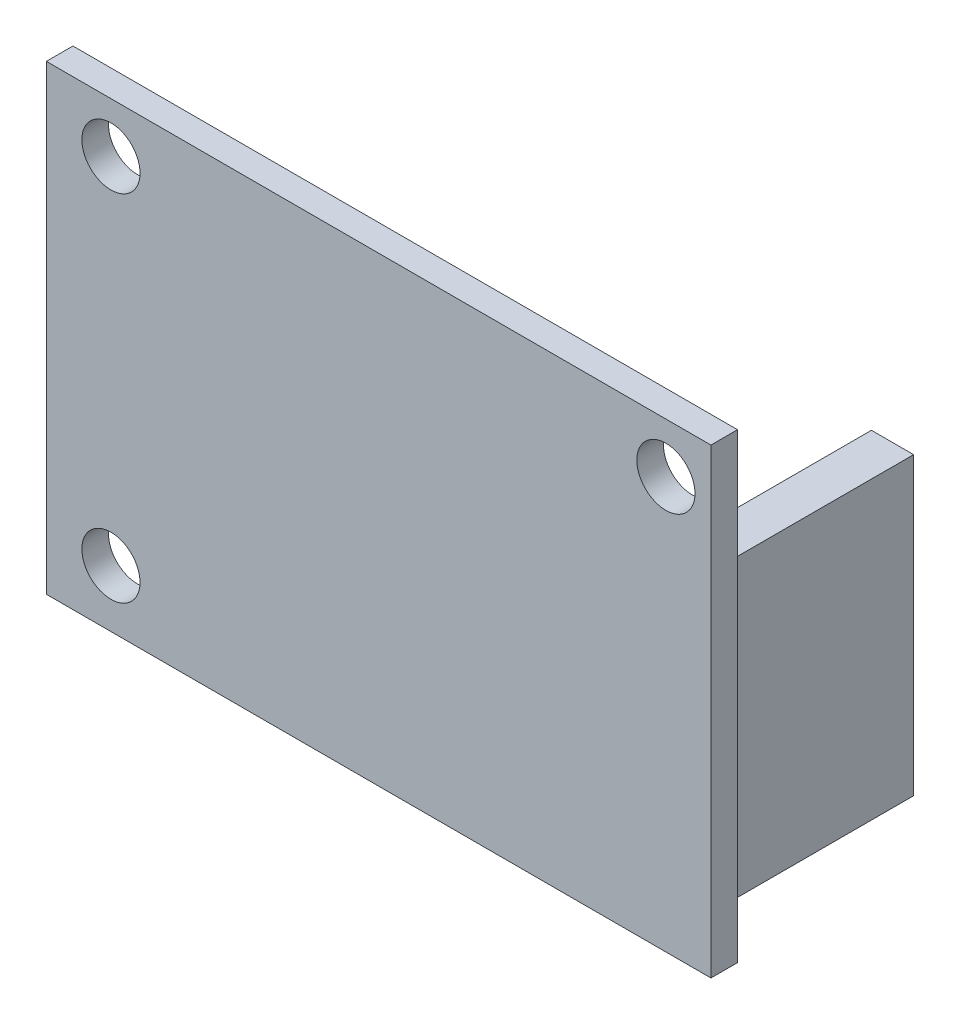
ISO-10303-21;
HEADER;
FILE_DESCRIPTION(('STEP AP214'),'2;1');
FILE_NAME('part.step','',(''),(''),'','','');
FILE_SCHEMA(('AUTOMOTIVE_DESIGN { 1 0 10303 214 1 1 1 1 }'));
ENDSEC;
DATA;
#1=APPLICATION_CONTEXT('core data for automotive mechanical design processes');
#2=APPLICATION_PROTOCOL_DEFINITION('international standard','automotive_design',2000,#1);
#3=PRODUCT_CONTEXT('',#1,'mechanical');
#4=PRODUCT('Part','Part','',(#3));
#5=PRODUCT_RELATED_PRODUCT_CATEGORY('part','',(#4));
#6=PRODUCT_DEFINITION_FORMATION('','',#4);
#7=PRODUCT_DEFINITION_CONTEXT('part definition',#1,'design');
#8=PRODUCT_DEFINITION('design','',#6,#7);
#9=PRODUCT_DEFINITION_SHAPE('','',#8);
#10=(LENGTH_UNIT() NAMED_UNIT(*) SI_UNIT(.MILLI.,.METRE.));
#11=(NAMED_UNIT(*) PLANE_ANGLE_UNIT() SI_UNIT($,.RADIAN.));
#12=(NAMED_UNIT(*) SI_UNIT($,.STERADIAN.) SOLID_ANGLE_UNIT());
#13=UNCERTAINTY_MEASURE_WITH_UNIT(LENGTH_MEASURE(1.E-05),#10,'distance_accuracy_value','');
#14=(GEOMETRIC_REPRESENTATION_CONTEXT(3) GLOBAL_UNCERTAINTY_ASSIGNED_CONTEXT((#13)) GLOBAL_UNIT_ASSIGNED_CONTEXT((#10,
#11,#12)) REPRESENTATION_CONTEXT('',''));
#15=CARTESIAN_POINT('',(0.,0.,0.));
#16=DIRECTION('',(0.,0.,1.));
#17=DIRECTION('',(1.,0.,0.));
#18=AXIS2_PLACEMENT_3D('',#15,#16,#17);
#19=CARTESIAN_POINT('',(-10.668018796038,55.372082804166,11.));
#20=DIRECTION('',(1.,0.,0.));
#21=DIRECTION('',(0.,1.,0.));
#22=AXIS2_PLACEMENT_3D('',#19,#20,#21);
#23=PLANE('',#22);
#24=DIRECTION('',(0.,-1.,0.));
#25=VECTOR('',#24,1.);
#26=CARTESIAN_POINT('',(-10.668018796038,55.372082804166,0.));
#27=LINE('',#26,#25);
#28=CARTESIAN_POINT('',(-10.668018796038,55.372082804166,0.));
#29=VERTEX_POINT('',#28);
#30=CARTESIAN_POINT('',(-10.668018796038,37.592082804166,0.));
#31=VERTEX_POINT('',#30);
#32=EDGE_CURVE('E134',#29,#31,#27,.T.);
#33=ORIENTED_EDGE('',*,*,#32,.T.);
#34=DIRECTION('',(0.,0.,-1.));
#35=VECTOR('',#34,1.);
#36=CARTESIAN_POINT('',(-10.668018796038,37.592082804166,11.));
#37=LINE('',#36,#35);
#38=CARTESIAN_POINT('',(-10.668018796038,37.592082804166,11.));
#39=VERTEX_POINT('',#38);
#40=EDGE_CURVE('E11',#39,#31,#37,.T.);
#41=ORIENTED_EDGE('',*,*,#40,.F.);
#42=DIRECTION('',(0.,-1.,0.));
#43=VECTOR('',#42,1.);
#44=CARTESIAN_POINT('',(-10.668018796038,55.372082804166,11.));
#45=LINE('',#44,#43);
#46=CARTESIAN_POINT('',(-10.668018796038,55.372082804166,11.));
#47=VERTEX_POINT('',#46);
#48=EDGE_CURVE('E143',#47,#39,#45,.T.);
#49=ORIENTED_EDGE('',*,*,#48,.F.);
#50=DIRECTION('',(0.,0.,-1.));
#51=VECTOR('',#50,1.);
#52=CARTESIAN_POINT('',(-10.668018796038,55.372082804166,11.));
#53=LINE('',#52,#51);
#54=EDGE_CURVE('E152',#47,#29,#53,.T.);
#55=ORIENTED_EDGE('',*,*,#54,.T.);
#56=EDGE_LOOP('',(#33,#41,#49,#55));
#57=FACE_BOUND('',#56,.T.);
#58=ADVANCED_FACE('F35',(#57),#23,.F.);
#59=CARTESIAN_POINT('',(-10.668018796038,37.592082804166,11.));
#60=DIRECTION('',(0.,1.,0.));
#61=DIRECTION('',(0.,0.,1.));
#62=AXIS2_PLACEMENT_3D('',#59,#60,#61);
#63=PLANE('',#62);
#64=DIRECTION('',(1.,0.,0.));
#65=VECTOR('',#64,1.);
#66=CARTESIAN_POINT('',(-10.668018796038,37.592082804166,0.));
#67=LINE('',#66,#65);
#68=CARTESIAN_POINT('',(-8.128018796038,37.592082804166,0.));
#69=VERTEX_POINT('',#68);
#70=EDGE_CURVE('E137',#31,#69,#67,.T.);
#71=ORIENTED_EDGE('',*,*,#70,.T.);
#72=DIRECTION('',(0.,0.,-1.));
#73=VECTOR('',#72,1.);
#74=CARTESIAN_POINT('',(-8.128018796038,37.592082804166,11.));
#75=LINE('',#74,#73);
#76=CARTESIAN_POINT('',(-8.128018796038,37.592082804166,11.));
#77=VERTEX_POINT('',#76);
#78=EDGE_CURVE('E43',#77,#69,#75,.T.);
#79=ORIENTED_EDGE('',*,*,#78,.F.);
#80=DIRECTION('',(1.,0.,0.));
#81=VECTOR('',#80,1.);
#82=CARTESIAN_POINT('',(-10.668018796038,37.592082804166,11.));
#83=LINE('',#82,#81);
#84=EDGE_CURVE('E77',#39,#77,#83,.T.);
#85=ORIENTED_EDGE('',*,*,#84,.F.);
#86=ORIENTED_EDGE('',*,*,#40,.T.);
#87=EDGE_LOOP('',(#71,#79,#85,#86));
#88=FACE_BOUND('',#87,.T.);
#89=ADVANCED_FACE('F222',(#88),#63,.F.);
#90=CARTESIAN_POINT('',(-8.128018796038,55.372082804166,11.));
#91=DIRECTION('',(-1.,0.,0.));
#92=DIRECTION('',(0.,-1.,0.));
#93=AXIS2_PLACEMENT_3D('',#90,#91,#92);
#94=PLANE('',#93);
#95=DIRECTION('',(0.,1.,0.));
#96=VECTOR('',#95,1.);
#97=CARTESIAN_POINT('',(-8.128018796038,55.372082804166,0.));
#98=LINE('',#97,#96);
#99=CARTESIAN_POINT('',(-8.128018796038,55.372082804166,0.));
#100=VERTEX_POINT('',#99);
#101=EDGE_CURVE('E67',#69,#100,#98,.T.);
#102=ORIENTED_EDGE('',*,*,#101,.T.);
#103=DIRECTION('',(0.,0.,-1.));
#104=VECTOR('',#103,1.);
#105=CARTESIAN_POINT('',(-8.128018796038,55.372082804166,11.));
#106=LINE('',#105,#104);
#107=CARTESIAN_POINT('',(-8.128018796038,55.372082804166,11.));
#108=VERTEX_POINT('',#107);
#109=EDGE_CURVE('E51',#108,#100,#106,.T.);
#110=ORIENTED_EDGE('',*,*,#109,.F.);
#111=DIRECTION('',(0.,1.,0.));
#112=VECTOR('',#111,1.);
#113=CARTESIAN_POINT('',(-8.128018796038,55.372082804166,11.));
#114=LINE('',#113,#112);
#115=EDGE_CURVE('E147',#77,#108,#114,.T.);
#116=ORIENTED_EDGE('',*,*,#115,.F.);
#117=ORIENTED_EDGE('',*,*,#78,.T.);
#118=EDGE_LOOP('',(#102,#110,#116,#117));
#119=FACE_BOUND('',#118,.T.);
#120=ADVANCED_FACE('F158',(#119),#94,.F.);
#121=CARTESIAN_POINT('',(-10.668018796038,55.372082804166,11.));
#122=DIRECTION('',(0.,-1.,0.));
#123=DIRECTION('',(0.,0.,-1.));
#124=AXIS2_PLACEMENT_3D('',#121,#122,#123);
#125=PLANE('',#124);
#126=DIRECTION('',(-1.,0.,0.));
#127=VECTOR('',#126,1.);
#128=CARTESIAN_POINT('',(-10.668018796038,55.372082804166,0.));
#129=LINE('',#128,#127);
#130=EDGE_CURVE('E72',#100,#29,#129,.T.);
#131=ORIENTED_EDGE('',*,*,#130,.T.);
#132=ORIENTED_EDGE('',*,*,#54,.F.);
#133=DIRECTION('',(-1.,0.,0.));
#134=VECTOR('',#133,1.);
#135=CARTESIAN_POINT('',(-10.668018796038,55.372082804166,11.));
#136=LINE('',#135,#134);
#137=EDGE_CURVE('E150',#108,#47,#136,.T.);
#138=ORIENTED_EDGE('',*,*,#137,.F.);
#139=ORIENTED_EDGE('',*,*,#109,.T.);
#140=EDGE_LOOP('',(#131,#132,#138,#139));
#141=FACE_BOUND('',#140,.T.);
#142=ADVANCED_FACE('F163',(#141),#125,.F.);
#143=CARTESIAN_POINT('',(0.,0.,0.));
#144=DIRECTION('',(0.,0.,1.));
#145=DIRECTION('',(1.,0.,0.));
#146=AXIS2_PLACEMENT_3D('',#143,#144,#145);
#147=PLANE('',#146);
#148=ORIENTED_EDGE('',*,*,#32,.F.);
#149=ORIENTED_EDGE('',*,*,#130,.F.);
#150=ORIENTED_EDGE('',*,*,#101,.F.);
#151=ORIENTED_EDGE('',*,*,#70,.F.);
#152=EDGE_LOOP('',(#148,#149,#150,#151));
#153=FACE_BOUND('',#152,.T.);
#154=ADVANCED_FACE('F161',(#153),#147,.F.);
#155=CARTESIAN_POINT('',(0.,0.,12.6));
#156=DIRECTION('',(0.,0.,-1.));
#157=DIRECTION('',(-1.,0.,0.));
#158=AXIS2_PLACEMENT_3D('',#155,#156,#157);
#159=PLANE('',#158);
#160=DIRECTION('',(0.,1.,0.));
#161=VECTOR('',#160,1.);
#162=CARTESIAN_POINT('',(-7.728018796038,62.372082804166,12.6));
#163=LINE('',#162,#161);
#164=CARTESIAN_POINT('',(-7.72801879603799,34.592082804166,12.6));
#165=VERTEX_POINT('',#164);
#166=CARTESIAN_POINT('',(-7.728018796038,62.372082804166,12.6));
#167=VERTEX_POINT('',#166);
#168=EDGE_CURVE('E119',#165,#167,#163,.T.);
#169=ORIENTED_EDGE('',*,*,#168,.T.);
#170=DIRECTION('',(-1.,0.,0.));
#171=VECTOR('',#170,1.);
#172=CARTESIAN_POINT('',(-7.728018796038,62.372082804166,12.6));
#173=LINE('',#172,#171);
#174=CARTESIAN_POINT('',(-47.728018796038,62.372082804166,12.6));
#175=VERTEX_POINT('',#174);
#176=EDGE_CURVE('E108',#167,#175,#173,.T.);
#177=ORIENTED_EDGE('',*,*,#176,.T.);
#178=DIRECTION('',(0.,-1.,0.));
#179=VECTOR('',#178,1.);
#180=CARTESIAN_POINT('',(-47.728018796038,62.372082804166,12.6));
#181=LINE('',#180,#179);
#182=CARTESIAN_POINT('',(-47.728018796038,34.592082804166,12.6));
#183=VERTEX_POINT('',#182);
#184=EDGE_CURVE('E118',#175,#183,#181,.T.);
#185=ORIENTED_EDGE('',*,*,#184,.T.);
#186=DIRECTION('',(1.,0.,0.));
#187=VECTOR('',#186,1.);
#188=CARTESIAN_POINT('',(-7.72801879603799,34.592082804166,12.6));
#189=LINE('',#188,#187);
#190=EDGE_CURVE('E125',#183,#165,#189,.T.);
#191=ORIENTED_EDGE('',*,*,#190,.T.);
#192=EDGE_LOOP('',(#169,#177,#185,#191));
#193=FACE_BOUND('',#192,.T.);
#194=CARTESIAN_POINT('',(-10.439420878842,59.359918719837,12.6));
#195=DIRECTION('',(0.,0.,1.));
#196=DIRECTION('',(1.,0.,0.));
#197=AXIS2_PLACEMENT_3D('',#194,#195,#196);
#198=CIRCLE('',#197,1.750012700025);
#199=CARTESIAN_POINT('',(-8.689408178817,59.359918719837,12.6));
#200=VERTEX_POINT('',#199);
#201=EDGE_CURVE('E192',#200,#200,#198,.T.);
#202=ORIENTED_EDGE('',*,*,#201,.F.);
#203=EDGE_LOOP('',(#202));
#204=FACE_BOUND('',#203,.T.);
#205=CARTESIAN_POINT('',(-43.840487680975,59.359918719837,12.6));
#206=DIRECTION('',(0.,0.,1.));
#207=DIRECTION('',(1.,0.,0.));
#208=AXIS2_PLACEMENT_3D('',#205,#206,#207);
#209=CIRCLE('',#208,1.75);
#210=CARTESIAN_POINT('',(-42.090487680975,59.359918719837,12.6));
#211=VERTEX_POINT('',#210);
#212=EDGE_CURVE('E188',#211,#211,#209,.T.);
#213=ORIENTED_EDGE('',*,*,#212,.F.);
#214=EDGE_LOOP('',(#213));
#215=FACE_BOUND('',#214,.T.);
#216=CARTESIAN_POINT('',(-43.840487680975,38.023876047752,12.6));
#217=DIRECTION('',(0.,0.,1.));
#218=DIRECTION('',(1.,0.,0.));
#219=AXIS2_PLACEMENT_3D('',#216,#217,#218);
#220=CIRCLE('',#219,1.75);
#221=CARTESIAN_POINT('',(-42.090487680975,38.023876047752,12.6));
#222=VERTEX_POINT('',#221);
#223=EDGE_CURVE('E183',#222,#222,#220,.T.);
#224=ORIENTED_EDGE('',*,*,#223,.F.);
#225=EDGE_LOOP('',(#224));
#226=FACE_BOUND('',#225,.T.);
#227=ADVANCED_FACE('F122',(#193,#204,#215,#226),#159,.F.);
#228=CARTESIAN_POINT('',(0.,0.,11.));
#229=DIRECTION('',(0.,0.,-1.));
#230=DIRECTION('',(-1.,0.,0.));
#231=AXIS2_PLACEMENT_3D('',#228,#229,#230);
#232=PLANE('',#231);
#233=ORIENTED_EDGE('',*,*,#137,.T.);
#234=ORIENTED_EDGE('',*,*,#48,.T.);
#235=ORIENTED_EDGE('',*,*,#84,.T.);
#236=ORIENTED_EDGE('',*,*,#115,.T.);
#237=EDGE_LOOP('',(#233,#234,#235,#236));
#238=FACE_BOUND('',#237,.T.);
#239=CARTESIAN_POINT('',(-43.840487680975,59.359918719837,11.));
#240=DIRECTION('',(0.,0.,1.));
#241=DIRECTION('',(1.,0.,0.));
#242=AXIS2_PLACEMENT_3D('',#239,#240,#241);
#243=CIRCLE('',#242,1.75);
#244=CARTESIAN_POINT('',(-42.090487680975,59.359918719837,11.));
#245=VERTEX_POINT('',#244);
#246=EDGE_CURVE('E172',#245,#245,#243,.T.);
#247=ORIENTED_EDGE('',*,*,#246,.T.);
#248=EDGE_LOOP('',(#247));
#249=FACE_BOUND('',#248,.T.);
#250=DIRECTION('',(0.,1.,0.));
#251=VECTOR('',#250,1.);
#252=CARTESIAN_POINT('',(-7.728018796038,62.372082804166,11.));
#253=LINE('',#252,#251);
#254=CARTESIAN_POINT('',(-7.72801879603799,34.592082804166,11.));
#255=VERTEX_POINT('',#254);
#256=CARTESIAN_POINT('',(-7.728018796038,62.372082804166,11.));
#257=VERTEX_POINT('',#256);
#258=EDGE_CURVE('E133',#255,#257,#253,.T.);
#259=ORIENTED_EDGE('',*,*,#258,.F.);
#260=DIRECTION('',(1.,0.,0.));
#261=VECTOR('',#260,1.);
#262=CARTESIAN_POINT('',(-7.72801879603799,34.592082804166,11.));
#263=LINE('',#262,#261);
#264=CARTESIAN_POINT('',(-47.728018796038,34.592082804166,11.));
#265=VERTEX_POINT('',#264);
#266=EDGE_CURVE('E129',#265,#255,#263,.T.);
#267=ORIENTED_EDGE('',*,*,#266,.F.);
#268=DIRECTION('',(0.,-1.,0.));
#269=VECTOR('',#268,1.);
#270=CARTESIAN_POINT('',(-47.728018796038,62.372082804166,11.));
#271=LINE('',#270,#269);
#272=CARTESIAN_POINT('',(-47.728018796038,62.372082804166,11.));
#273=VERTEX_POINT('',#272);
#274=EDGE_CURVE('E202',#273,#265,#271,.T.);
#275=ORIENTED_EDGE('',*,*,#274,.F.);
#276=DIRECTION('',(-1.,0.,0.));
#277=VECTOR('',#276,1.);
#278=CARTESIAN_POINT('',(-7.728018796038,62.372082804166,11.));
#279=LINE('',#278,#277);
#280=EDGE_CURVE('E200',#257,#273,#279,.T.);
#281=ORIENTED_EDGE('',*,*,#280,.F.);
#282=EDGE_LOOP('',(#259,#267,#275,#281));
#283=FACE_BOUND('',#282,.T.);
#284=CARTESIAN_POINT('',(-10.439420878842,59.359918719837,11.));
#285=DIRECTION('',(0.,0.,1.));
#286=DIRECTION('',(1.,0.,0.));
#287=AXIS2_PLACEMENT_3D('',#284,#285,#286);
#288=CIRCLE('',#287,1.750012700025);
#289=CARTESIAN_POINT('',(-8.689408178817,59.359918719837,11.));
#290=VERTEX_POINT('',#289);
#291=EDGE_CURVE('E178',#290,#290,#288,.T.);
#292=ORIENTED_EDGE('',*,*,#291,.T.);
#293=EDGE_LOOP('',(#292));
#294=FACE_BOUND('',#293,.T.);
#295=CARTESIAN_POINT('',(-43.840487680975,38.023876047752,11.));
#296=DIRECTION('',(0.,0.,1.));
#297=DIRECTION('',(1.,0.,0.));
#298=AXIS2_PLACEMENT_3D('',#295,#296,#297);
#299=CIRCLE('',#298,1.75);
#300=CARTESIAN_POINT('',(-42.090487680975,38.023876047752,11.));
#301=VERTEX_POINT('',#300);
#302=EDGE_CURVE('E181',#301,#301,#299,.T.);
#303=ORIENTED_EDGE('',*,*,#302,.T.);
#304=EDGE_LOOP('',(#303));
#305=FACE_BOUND('',#304,.T.);
#306=ADVANCED_FACE('F165',(#238,#249,#283,#294,#305),#232,.T.);
#307=CARTESIAN_POINT('',(-7.728018796038,62.372082804166,12.6));
#308=DIRECTION('',(-1.,0.,0.));
#309=DIRECTION('',(0.,-1.,0.));
#310=AXIS2_PLACEMENT_3D('',#307,#308,#309);
#311=PLANE('',#310);
#312=ORIENTED_EDGE('',*,*,#258,.T.);
#313=DIRECTION('',(0.,0.,-1.));
#314=VECTOR('',#313,1.);
#315=CARTESIAN_POINT('',(-7.728018796038,62.372082804166,12.6));
#316=LINE('',#315,#314);
#317=EDGE_CURVE('E112',#167,#257,#316,.T.);
#318=ORIENTED_EDGE('',*,*,#317,.F.);
#319=ORIENTED_EDGE('',*,*,#168,.F.);
#320=DIRECTION('',(0.,0.,-1.));
#321=VECTOR('',#320,1.);
#322=CARTESIAN_POINT('',(-7.72801879603799,34.592082804166,12.6));
#323=LINE('',#322,#321);
#324=EDGE_CURVE('E198',#165,#255,#323,.T.);
#325=ORIENTED_EDGE('',*,*,#324,.T.);
#326=EDGE_LOOP('',(#312,#318,#319,#325));
#327=FACE_BOUND('',#326,.T.);
#328=ADVANCED_FACE('F131',(#327),#311,.F.);
#329=CARTESIAN_POINT('',(-7.728018796038,62.372082804166,12.6));
#330=DIRECTION('',(0.,-1.,0.));
#331=DIRECTION('',(1.,0.,0.));
#332=AXIS2_PLACEMENT_3D('',#329,#330,#331);
#333=PLANE('',#332);
#334=ORIENTED_EDGE('',*,*,#280,.T.);
#335=DIRECTION('',(0.,0.,-1.));
#336=VECTOR('',#335,1.);
#337=CARTESIAN_POINT('',(-47.728018796038,62.372082804166,12.6));
#338=LINE('',#337,#336);
#339=EDGE_CURVE('E115',#175,#273,#338,.T.);
#340=ORIENTED_EDGE('',*,*,#339,.F.);
#341=ORIENTED_EDGE('',*,*,#176,.F.);
#342=ORIENTED_EDGE('',*,*,#317,.T.);
#343=EDGE_LOOP('',(#334,#340,#341,#342));
#344=FACE_BOUND('',#343,.T.);
#345=ADVANCED_FACE('F110',(#344),#333,.F.);
#346=CARTESIAN_POINT('',(-47.728018796038,62.372082804166,12.6));
#347=DIRECTION('',(1.,0.,0.));
#348=DIRECTION('',(0.,0.,-1.));
#349=AXIS2_PLACEMENT_3D('',#346,#347,#348);
#350=PLANE('',#349);
#351=ORIENTED_EDGE('',*,*,#274,.T.);
#352=DIRECTION('',(0.,0.,-1.));
#353=VECTOR('',#352,1.);
#354=CARTESIAN_POINT('',(-47.728018796038,34.592082804166,12.6));
#355=LINE('',#354,#353);
#356=EDGE_CURVE('E139',#183,#265,#355,.T.);
#357=ORIENTED_EDGE('',*,*,#356,.F.);
#358=ORIENTED_EDGE('',*,*,#184,.F.);
#359=ORIENTED_EDGE('',*,*,#339,.T.);
#360=EDGE_LOOP('',(#351,#357,#358,#359));
#361=FACE_BOUND('',#360,.T.);
#362=ADVANCED_FACE('F211',(#361),#350,.F.);
#363=CARTESIAN_POINT('',(-7.72801879603799,34.592082804166,12.6));
#364=DIRECTION('',(0.,1.,0.));
#365=DIRECTION('',(-1.,0.,0.));
#366=AXIS2_PLACEMENT_3D('',#363,#364,#365);
#367=PLANE('',#366);
#368=ORIENTED_EDGE('',*,*,#266,.T.);
#369=ORIENTED_EDGE('',*,*,#324,.F.);
#370=ORIENTED_EDGE('',*,*,#190,.F.);
#371=ORIENTED_EDGE('',*,*,#356,.T.);
#372=EDGE_LOOP('',(#368,#369,#370,#371));
#373=FACE_BOUND('',#372,.T.);
#374=ADVANCED_FACE('F208',(#373),#367,.F.);
#375=CARTESIAN_POINT('',(-10.439420878842,59.359918719837,12.6));
#376=DIRECTION('',(0.,0.,-1.));
#377=DIRECTION('',(-1.,0.,0.));
#378=AXIS2_PLACEMENT_3D('',#375,#376,#377);
#379=CYLINDRICAL_SURFACE('',#378,1.750012700025);
#380=ORIENTED_EDGE('',*,*,#201,.T.);
#381=EDGE_LOOP('',(#380));
#382=FACE_BOUND('',#381,.T.);
#383=ORIENTED_EDGE('',*,*,#291,.F.);
#384=EDGE_LOOP('',(#383));
#385=FACE_BOUND('',#384,.T.);
#386=ADVANCED_FACE('F218',(#382,#385),#379,.F.);
#387=CARTESIAN_POINT('',(-43.840487680975,59.359918719837,12.6));
#388=DIRECTION('',(0.,0.,-1.));
#389=DIRECTION('',(-1.,0.,0.));
#390=AXIS2_PLACEMENT_3D('',#387,#388,#389);
#391=CYLINDRICAL_SURFACE('',#390,1.75);
#392=ORIENTED_EDGE('',*,*,#212,.T.);
#393=EDGE_LOOP('',(#392));
#394=FACE_BOUND('',#393,.T.);
#395=ORIENTED_EDGE('',*,*,#246,.F.);
#396=EDGE_LOOP('',(#395));
#397=FACE_BOUND('',#396,.T.);
#398=ADVANCED_FACE('F264',(#394,#397),#391,.F.);
#399=CARTESIAN_POINT('',(-43.840487680975,38.023876047752,12.6));
#400=DIRECTION('',(0.,0.,-1.));
#401=DIRECTION('',(-1.,0.,0.));
#402=AXIS2_PLACEMENT_3D('',#399,#400,#401);
#403=CYLINDRICAL_SURFACE('',#402,1.75);
#404=ORIENTED_EDGE('',*,*,#223,.T.);
#405=EDGE_LOOP('',(#404));
#406=FACE_BOUND('',#405,.T.);
#407=ORIENTED_EDGE('',*,*,#302,.F.);
#408=EDGE_LOOP('',(#407));
#409=FACE_BOUND('',#408,.T.);
#410=ADVANCED_FACE('F274',(#406,#409),#403,.F.);
#411=CLOSED_SHELL('',(#58,#89,#120,#142,#154,#227,#306,#328,#345,#362,#374,#386,#398,#410));
#412=MANIFOLD_SOLID_BREP('B2',#411);
#413=ADVANCED_BREP_SHAPE_REPRESENTATION('',(#18,#412),#14);
#414=SHAPE_DEFINITION_REPRESENTATION(#9,#413);
ENDSEC;
END-ISO-10303-21;
